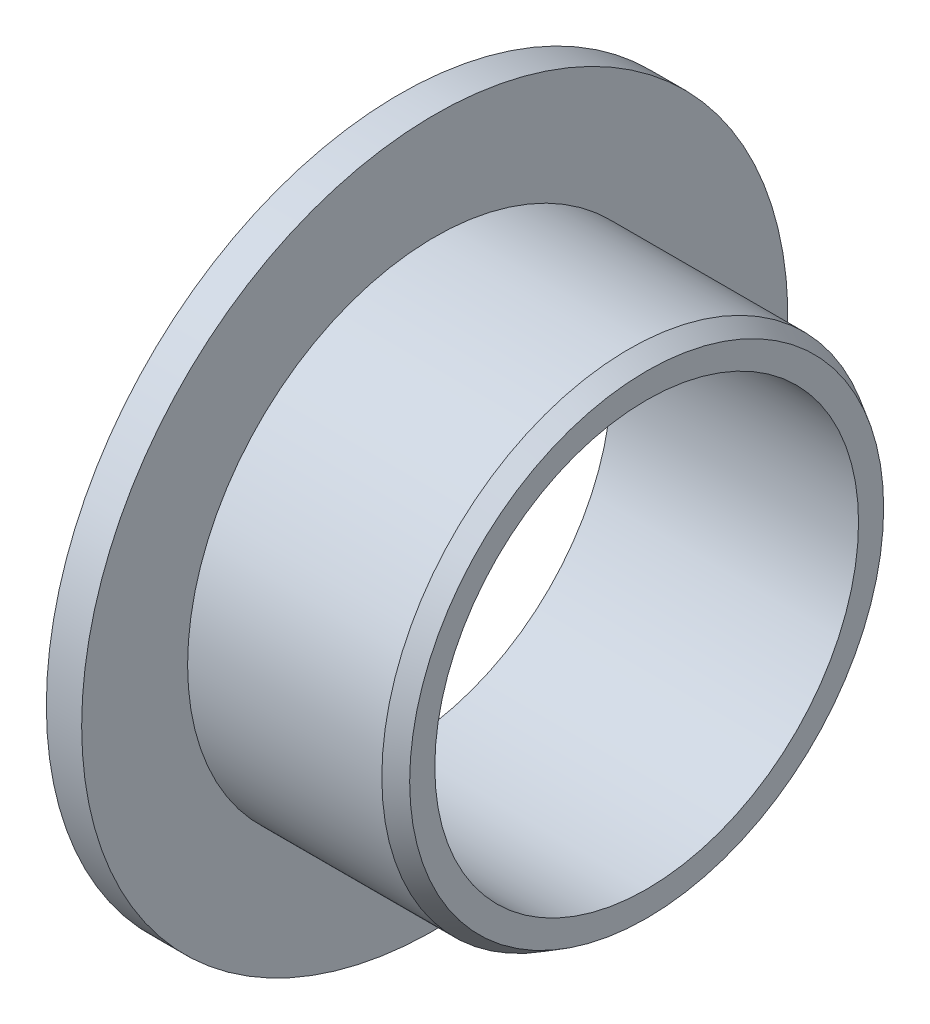
ISO-10303-21;
HEADER;
FILE_DESCRIPTION(('STEP AP214'),'2;1');
FILE_NAME('part.step','',(''),(''),'','','');
FILE_SCHEMA(('AUTOMOTIVE_DESIGN { 1 0 10303 214 1 1 1 1 }'));
ENDSEC;
DATA;
#1=APPLICATION_CONTEXT('core data for automotive mechanical design processes');
#2=APPLICATION_PROTOCOL_DEFINITION('international standard','automotive_design',2000,#1);
#3=PRODUCT_CONTEXT('',#1,'mechanical');
#4=PRODUCT('Part','Part','',(#3));
#5=PRODUCT_RELATED_PRODUCT_CATEGORY('part','',(#4));
#6=PRODUCT_DEFINITION_FORMATION('','',#4);
#7=PRODUCT_DEFINITION_CONTEXT('part definition',#1,'design');
#8=PRODUCT_DEFINITION('design','',#6,#7);
#9=PRODUCT_DEFINITION_SHAPE('','',#8);
#10=(LENGTH_UNIT() NAMED_UNIT(*) SI_UNIT(.MILLI.,.METRE.));
#11=(NAMED_UNIT(*) PLANE_ANGLE_UNIT() SI_UNIT($,.RADIAN.));
#12=(NAMED_UNIT(*) SI_UNIT($,.STERADIAN.) SOLID_ANGLE_UNIT());
#13=UNCERTAINTY_MEASURE_WITH_UNIT(LENGTH_MEASURE(1.E-05),#10,'distance_accuracy_value','');
#14=(GEOMETRIC_REPRESENTATION_CONTEXT(3) GLOBAL_UNCERTAINTY_ASSIGNED_CONTEXT((#13)) GLOBAL_UNIT_ASSIGNED_CONTEXT((#10,
#11,#12)) REPRESENTATION_CONTEXT('',''));
#15=CARTESIAN_POINT('',(0.,0.,0.));
#16=DIRECTION('',(0.,0.,1.));
#17=DIRECTION('',(1.,0.,0.));
#18=AXIS2_PLACEMENT_3D('',#15,#16,#17);
#19=CARTESIAN_POINT('',(0.,6.00000000000002,2.22044604925031E-13));
#20=DIRECTION('',(1.,0.,0.));
#21=DIRECTION('',(0.,0.,-1.));
#22=AXIS2_PLACEMENT_3D('',#19,#20,#21);
#23=PLANE('',#22);
#24=CARTESIAN_POINT('',(0.,0.,0.));
#25=DIRECTION('',(-1.,0.,0.));
#26=DIRECTION('',(0.,0.,1.));
#27=AXIS2_PLACEMENT_3D('',#24,#25,#26);
#28=CIRCLE('',#27,6.);
#29=CARTESIAN_POINT('',(0.,0.,6.00000000000001));
#30=VERTEX_POINT('',#29);
#31=EDGE_CURVE('E73',#30,#30,#28,.T.);
#32=ORIENTED_EDGE('',*,*,#31,.F.);
#33=EDGE_LOOP('',(#32));
#34=FACE_BOUND('',#33,.T.);
#35=CARTESIAN_POINT('',(0.,0.,0.));
#36=DIRECTION('',(-1.,0.,0.));
#37=DIRECTION('',(0.,0.,1.));
#38=AXIS2_PLACEMENT_3D('',#35,#36,#37);
#39=CIRCLE('',#38,10.);
#40=CARTESIAN_POINT('',(0.,0.,10.));
#41=VERTEX_POINT('',#40);
#42=EDGE_CURVE('E53',#41,#41,#39,.T.);
#43=ORIENTED_EDGE('',*,*,#42,.T.);
#44=EDGE_LOOP('',(#43));
#45=FACE_BOUND('',#44,.T.);
#46=ADVANCED_FACE('F38',(#34,#45),#23,.F.);
#47=CARTESIAN_POINT('',(0.,0.,0.));
#48=DIRECTION('',(-1.,0.,0.));
#49=DIRECTION('',(0.,0.,1.));
#50=AXIS2_PLACEMENT_3D('',#47,#48,#49);
#51=CYLINDRICAL_SURFACE('',#50,10.);
#52=ORIENTED_EDGE('',*,*,#42,.F.);
#53=EDGE_LOOP('',(#52));
#54=FACE_BOUND('',#53,.T.);
#55=CARTESIAN_POINT('',(1.,0.,0.));
#56=DIRECTION('',(-1.,0.,0.));
#57=DIRECTION('',(0.,0.,1.));
#58=AXIS2_PLACEMENT_3D('',#55,#56,#57);
#59=CIRCLE('',#58,10.);
#60=CARTESIAN_POINT('',(1.,0.,10.));
#61=VERTEX_POINT('',#60);
#62=EDGE_CURVE('E59',#61,#61,#59,.T.);
#63=ORIENTED_EDGE('',*,*,#62,.T.);
#64=EDGE_LOOP('',(#63));
#65=FACE_BOUND('',#64,.T.);
#66=ADVANCED_FACE('F83',(#54,#65),#51,.T.);
#67=CARTESIAN_POINT('',(1.,9.99999999999997,0.));
#68=DIRECTION('',(-1.,0.,0.));
#69=DIRECTION('',(0.,0.,1.));
#70=AXIS2_PLACEMENT_3D('',#67,#68,#69);
#71=PLANE('',#70);
#72=ORIENTED_EDGE('',*,*,#62,.F.);
#73=EDGE_LOOP('',(#72));
#74=FACE_BOUND('',#73,.T.);
#75=CARTESIAN_POINT('',(1.,0.,0.));
#76=DIRECTION('',(-1.,0.,0.));
#77=DIRECTION('',(0.,0.,1.));
#78=AXIS2_PLACEMENT_3D('',#75,#76,#77);
#79=CIRCLE('',#78,7.);
#80=CARTESIAN_POINT('',(1.,0.,7.00000000000001));
#81=VERTEX_POINT('',#80);
#82=EDGE_CURVE('E65',#81,#81,#79,.T.);
#83=ORIENTED_EDGE('',*,*,#82,.T.);
#84=EDGE_LOOP('',(#83));
#85=FACE_BOUND('',#84,.T.);
#86=ADVANCED_FACE('F88',(#74,#85),#71,.F.);
#87=CARTESIAN_POINT('',(0.,0.,0.));
#88=DIRECTION('',(-1.,0.,0.));
#89=DIRECTION('',(0.,0.,1.));
#90=AXIS2_PLACEMENT_3D('',#87,#88,#89);
#91=CYLINDRICAL_SURFACE('',#90,7.);
#92=CARTESIAN_POINT('',(6.50000000000001,0.,0.));
#93=DIRECTION('',(-1.,0.,0.));
#94=DIRECTION('',(0.,0.,1.));
#95=AXIS2_PLACEMENT_3D('',#92,#93,#94);
#96=CIRCLE('',#95,7.);
#97=CARTESIAN_POINT('',(6.50000000000001,0.,7.00000000000001));
#98=VERTEX_POINT('',#97);
#99=EDGE_CURVE('E47',#98,#98,#96,.T.);
#100=ORIENTED_EDGE('',*,*,#99,.T.);
#101=EDGE_LOOP('',(#100));
#102=FACE_BOUND('',#101,.T.);
#103=ORIENTED_EDGE('',*,*,#82,.F.);
#104=EDGE_LOOP('',(#103));
#105=FACE_BOUND('',#104,.T.);
#106=ADVANCED_FACE('F94',(#102,#105),#91,.T.);
#107=CARTESIAN_POINT('',(6.99999999999998,6.00000000000002,2.79290479632266E-13));
#108=DIRECTION('',(-1.,0.,0.));
#109=DIRECTION('',(0.,0.,1.));
#110=AXIS2_PLACEMENT_3D('',#107,#108,#109);
#111=PLANE('',#110);
#112=CARTESIAN_POINT('',(7.00000000000001,0.,0.));
#113=DIRECTION('',(-1.,0.,0.));
#114=DIRECTION('',(0.,0.,1.));
#115=AXIS2_PLACEMENT_3D('',#112,#113,#114);
#116=CIRCLE('',#115,6.71132486540519);
#117=CARTESIAN_POINT('',(7.00000000000001,0.,6.7113248654052));
#118=VERTEX_POINT('',#117);
#119=EDGE_CURVE('E10',#118,#118,#116,.F.);
#120=ORIENTED_EDGE('',*,*,#119,.T.);
#121=EDGE_LOOP('',(#120));
#122=FACE_BOUND('',#121,.T.);
#123=CARTESIAN_POINT('',(7.00000000000001,0.,0.));
#124=DIRECTION('',(-1.,0.,0.));
#125=DIRECTION('',(0.,0.,1.));
#126=AXIS2_PLACEMENT_3D('',#123,#124,#125);
#127=CIRCLE('',#126,6.);
#128=CARTESIAN_POINT('',(7.00000000000001,0.,6.00000000000001));
#129=VERTEX_POINT('',#128);
#130=EDGE_CURVE('E69',#129,#129,#127,.T.);
#131=ORIENTED_EDGE('',*,*,#130,.T.);
#132=EDGE_LOOP('',(#131));
#133=FACE_BOUND('',#132,.T.);
#134=ADVANCED_FACE('F99',(#122,#133),#111,.F.);
#135=CARTESIAN_POINT('',(0.,0.,0.));
#136=DIRECTION('',(-1.,0.,0.));
#137=DIRECTION('',(0.,0.,1.));
#138=AXIS2_PLACEMENT_3D('',#135,#136,#137);
#139=CYLINDRICAL_SURFACE('',#138,6.);
#140=ORIENTED_EDGE('',*,*,#130,.F.);
#141=EDGE_LOOP('',(#140));
#142=FACE_BOUND('',#141,.T.);
#143=ORIENTED_EDGE('',*,*,#31,.T.);
#144=EDGE_LOOP('',(#143));
#145=FACE_BOUND('',#144,.T.);
#146=ADVANCED_FACE('F79',(#142,#145),#139,.F.);
#147=CARTESIAN_POINT('',(6.50000000000001,0.,0.));
#148=DIRECTION('',(-1.,0.,0.));
#149=DIRECTION('',(0.,0.,1.));
#150=AXIS2_PLACEMENT_3D('',#147,#148,#149);
#151=CONICAL_SURFACE('',#150,7.,0.523598775598298);
#152=ORIENTED_EDGE('',*,*,#119,.F.);
#153=EDGE_LOOP('',(#152));
#154=FACE_BOUND('',#153,.T.);
#155=ORIENTED_EDGE('',*,*,#99,.F.);
#156=EDGE_LOOP('',(#155));
#157=FACE_BOUND('',#156,.T.);
#158=ADVANCED_FACE('F41',(#154,#157),#151,.T.);
#159=CLOSED_SHELL('',(#46,#66,#86,#106,#134,#146,#158));
#160=MANIFOLD_SOLID_BREP('B2',#159);
#161=ADVANCED_BREP_SHAPE_REPRESENTATION('',(#18,#160),#14);
#162=SHAPE_DEFINITION_REPRESENTATION(#9,#161);
ENDSEC;
END-ISO-10303-21;
